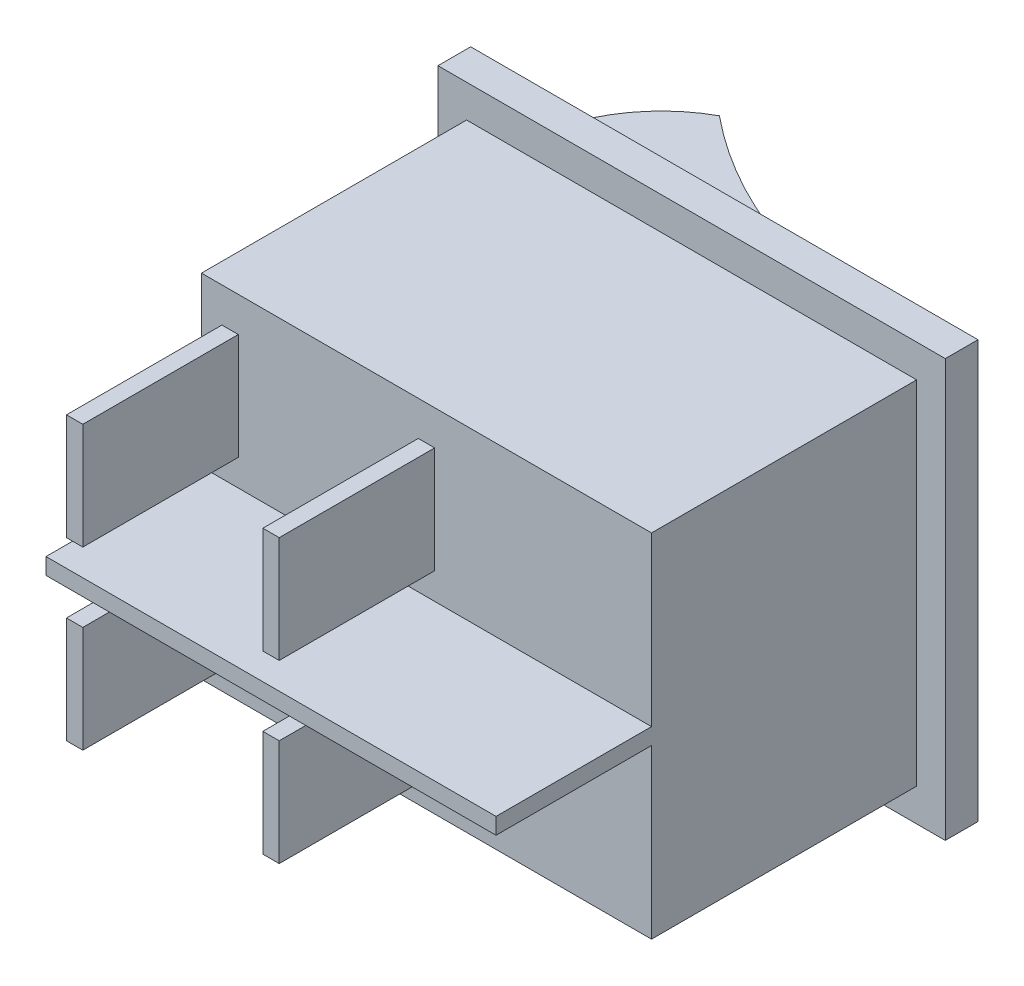
ISO-10303-21;
HEADER;
FILE_DESCRIPTION(('STEP AP214'),'2;1');
FILE_NAME('part.step','',(''),(''),'','','');
FILE_SCHEMA(('AUTOMOTIVE_DESIGN { 1 0 10303 214 1 1 1 1 }'));
ENDSEC;
DATA;
#1=APPLICATION_CONTEXT('core data for automotive mechanical design processes');
#2=APPLICATION_PROTOCOL_DEFINITION('international standard','automotive_design',2000,#1);
#3=PRODUCT_CONTEXT('',#1,'mechanical');
#4=PRODUCT('Part','Part','',(#3));
#5=PRODUCT_RELATED_PRODUCT_CATEGORY('part','',(#4));
#6=PRODUCT_DEFINITION_FORMATION('','',#4);
#7=PRODUCT_DEFINITION_CONTEXT('part definition',#1,'design');
#8=PRODUCT_DEFINITION('design','',#6,#7);
#9=PRODUCT_DEFINITION_SHAPE('','',#8);
#10=(LENGTH_UNIT() NAMED_UNIT(*) SI_UNIT(.MILLI.,.METRE.));
#11=(NAMED_UNIT(*) PLANE_ANGLE_UNIT() SI_UNIT($,.RADIAN.));
#12=(NAMED_UNIT(*) SI_UNIT($,.STERADIAN.) SOLID_ANGLE_UNIT());
#13=UNCERTAINTY_MEASURE_WITH_UNIT(LENGTH_MEASURE(1.E-05),#10,'distance_accuracy_value','');
#14=(GEOMETRIC_REPRESENTATION_CONTEXT(3) GLOBAL_UNCERTAINTY_ASSIGNED_CONTEXT((#13)) GLOBAL_UNIT_ASSIGNED_CONTEXT((#10,
#11,#12)) REPRESENTATION_CONTEXT('',''));
#15=CARTESIAN_POINT('',(0.,0.,0.));
#16=DIRECTION('',(0.,0.,1.));
#17=DIRECTION('',(1.,0.,0.));
#18=AXIS2_PLACEMENT_3D('',#15,#16,#17);
#19=CARTESIAN_POINT('',(0.,0.,0.));
#20=DIRECTION('',(0.,0.,1.));
#21=DIRECTION('',(1.,0.,0.));
#22=AXIS2_PLACEMENT_3D('',#19,#20,#21);
#23=PLANE('',#22);
#24=DIRECTION('',(0.,-1.,0.));
#25=VECTOR('',#24,1.);
#26=CARTESIAN_POINT('',(-15.5,-12.75,0.));
#27=LINE('',#26,#25);
#28=CARTESIAN_POINT('',(-15.5,12.75,0.));
#29=VERTEX_POINT('',#28);
#30=CARTESIAN_POINT('',(-15.5,-12.75,0.));
#31=VERTEX_POINT('',#30);
#32=EDGE_CURVE('E489',#29,#31,#27,.T.);
#33=ORIENTED_EDGE('',*,*,#32,.F.);
#34=DIRECTION('',(-1.,0.,0.));
#35=VECTOR('',#34,1.);
#36=CARTESIAN_POINT('',(15.5,12.75,0.));
#37=LINE('',#36,#35);
#38=CARTESIAN_POINT('',(15.5,12.75,0.));
#39=VERTEX_POINT('',#38);
#40=EDGE_CURVE('E494',#39,#29,#37,.T.);
#41=ORIENTED_EDGE('',*,*,#40,.F.);
#42=DIRECTION('',(0.,1.,0.));
#43=VECTOR('',#42,1.);
#44=CARTESIAN_POINT('',(15.5,-12.75,0.));
#45=LINE('',#44,#43);
#46=CARTESIAN_POINT('',(15.5,-12.75,0.));
#47=VERTEX_POINT('',#46);
#48=EDGE_CURVE('E505',#47,#39,#45,.T.);
#49=ORIENTED_EDGE('',*,*,#48,.F.);
#50=DIRECTION('',(1.,0.,0.));
#51=VECTOR('',#50,1.);
#52=CARTESIAN_POINT('',(15.5,-12.75,0.));
#53=LINE('',#52,#51);
#54=EDGE_CURVE('E503',#31,#47,#53,.T.);
#55=ORIENTED_EDGE('',*,*,#54,.F.);
#56=EDGE_LOOP('',(#33,#41,#49,#55));
#57=FACE_BOUND('',#56,.T.);
#58=DIRECTION('',(0.,-1.,0.));
#59=VECTOR('',#58,1.);
#60=CARTESIAN_POINT('',(12.,-9.5,0.));
#61=LINE('',#60,#59);
#62=CARTESIAN_POINT('',(12.,9.5,0.));
#63=VERTEX_POINT('',#62);
#64=CARTESIAN_POINT('',(12.,-9.5,0.));
#65=VERTEX_POINT('',#64);
#66=EDGE_CURVE('E58',#63,#65,#61,.T.);
#67=ORIENTED_EDGE('',*,*,#66,.F.);
#68=DIRECTION('',(1.,0.,0.));
#69=VECTOR('',#68,1.);
#70=CARTESIAN_POINT('',(-12.,9.50000000000001,0.));
#71=LINE('',#70,#69);
#72=CARTESIAN_POINT('',(-12.,9.50000000000001,0.));
#73=VERTEX_POINT('',#72);
#74=EDGE_CURVE('E289',#73,#63,#71,.T.);
#75=ORIENTED_EDGE('',*,*,#74,.F.);
#76=DIRECTION('',(0.,1.,0.));
#77=VECTOR('',#76,1.);
#78=CARTESIAN_POINT('',(-12.,-9.49999999999999,0.));
#79=LINE('',#78,#77);
#80=CARTESIAN_POINT('',(-12.,-9.49999999999999,0.));
#81=VERTEX_POINT('',#80);
#82=EDGE_CURVE('E298',#81,#73,#79,.T.);
#83=ORIENTED_EDGE('',*,*,#82,.F.);
#84=DIRECTION('',(-1.,0.,0.));
#85=VECTOR('',#84,1.);
#86=CARTESIAN_POINT('',(-12.,-9.49999999999999,0.));
#87=LINE('',#86,#85);
#88=EDGE_CURVE('E295',#65,#81,#87,.T.);
#89=ORIENTED_EDGE('',*,*,#88,.F.);
#90=EDGE_LOOP('',(#67,#75,#83,#89));
#91=FACE_BOUND('',#90,.T.);
#92=ADVANCED_FACE('F35',(#57,#91),#23,.F.);
#93=CARTESIAN_POINT('',(0.,0.,18.2));
#94=DIRECTION('',(0.,0.,1.));
#95=DIRECTION('',(1.,0.,0.));
#96=AXIS2_PLACEMENT_3D('',#93,#94,#95);
#97=PLANE('',#96);
#98=DIRECTION('',(-1.,0.,0.));
#99=VECTOR('',#98,1.);
#100=CARTESIAN_POINT('',(0.5,-2.125,18.2));
#101=LINE('',#100,#99);
#102=CARTESIAN_POINT('',(0.5,-2.125,18.2));
#103=VERTEX_POINT('',#102);
#104=CARTESIAN_POINT('',(-0.500000000000001,-2.125,18.2));
#105=VERTEX_POINT('',#104);
#106=EDGE_CURVE('E382',#103,#105,#101,.T.);
#107=ORIENTED_EDGE('',*,*,#106,.F.);
#108=DIRECTION('',(0.,1.,0.));
#109=VECTOR('',#108,1.);
#110=CARTESIAN_POINT('',(0.5,-2.125,18.2));
#111=LINE('',#110,#109);
#112=CARTESIAN_POINT('',(0.5,-8.625,18.2));
#113=VERTEX_POINT('',#112);
#114=EDGE_CURVE('E368',#113,#103,#111,.T.);
#115=ORIENTED_EDGE('',*,*,#114,.F.);
#116=DIRECTION('',(1.,0.,0.));
#117=VECTOR('',#116,1.);
#118=CARTESIAN_POINT('',(0.5,-8.625,18.2));
#119=LINE('',#118,#117);
#120=CARTESIAN_POINT('',(-0.500000000000001,-8.625,18.2));
#121=VERTEX_POINT('',#120);
#122=EDGE_CURVE('E373',#121,#113,#119,.T.);
#123=ORIENTED_EDGE('',*,*,#122,.F.);
#124=DIRECTION('',(0.,-1.,0.));
#125=VECTOR('',#124,1.);
#126=CARTESIAN_POINT('',(-0.500000000000001,-2.125,18.2));
#127=LINE('',#126,#125);
#128=EDGE_CURVE('E384',#105,#121,#127,.T.);
#129=ORIENTED_EDGE('',*,*,#128,.F.);
#130=EDGE_LOOP('',(#107,#115,#123,#129));
#131=FACE_BOUND('',#130,.T.);
#132=DIRECTION('',(-1.,0.,0.));
#133=VECTOR('',#132,1.);
#134=CARTESIAN_POINT('',(-11.5,-2.125,18.2));
#135=LINE('',#134,#133);
#136=CARTESIAN_POINT('',(-11.5,-2.125,18.2));
#137=VERTEX_POINT('',#136);
#138=CARTESIAN_POINT('',(-12.5,-2.125,18.2));
#139=VERTEX_POINT('',#138);
#140=EDGE_CURVE('E353',#137,#139,#135,.T.);
#141=ORIENTED_EDGE('',*,*,#140,.F.);
#142=DIRECTION('',(0.,1.,0.));
#143=VECTOR('',#142,1.);
#144=CARTESIAN_POINT('',(-11.5,-2.125,18.2));
#145=LINE('',#144,#143);
#146=CARTESIAN_POINT('',(-11.5,-8.625,18.2));
#147=VERTEX_POINT('',#146);
#148=EDGE_CURVE('E339',#147,#137,#145,.T.);
#149=ORIENTED_EDGE('',*,*,#148,.F.);
#150=DIRECTION('',(1.,0.,0.));
#151=VECTOR('',#150,1.);
#152=CARTESIAN_POINT('',(-11.5,-8.625,18.2));
#153=LINE('',#152,#151);
#154=CARTESIAN_POINT('',(-12.5,-8.625,18.2));
#155=VERTEX_POINT('',#154);
#156=EDGE_CURVE('E344',#155,#147,#153,.T.);
#157=ORIENTED_EDGE('',*,*,#156,.F.);
#158=DIRECTION('',(0.,-1.,0.));
#159=VECTOR('',#158,1.);
#160=CARTESIAN_POINT('',(-12.5,-2.125,18.2));
#161=LINE('',#160,#159);
#162=EDGE_CURVE('E355',#139,#155,#161,.T.);
#163=ORIENTED_EDGE('',*,*,#162,.F.);
#164=EDGE_LOOP('',(#141,#149,#157,#163));
#165=FACE_BOUND('',#164,.T.);
#166=DIRECTION('',(0.,1.,0.));
#167=VECTOR('',#166,1.);
#168=CARTESIAN_POINT('',(13.75,-10.75,18.2));
#169=LINE('',#168,#167);
#170=CARTESIAN_POINT('',(13.75,-10.75,18.2));
#171=VERTEX_POINT('',#170);
#172=CARTESIAN_POINT('',(13.75,-0.5,18.2));
#173=VERTEX_POINT('',#172);
#174=EDGE_CURVE('E462',#171,#173,#169,.T.);
#175=ORIENTED_EDGE('',*,*,#174,.T.);
#176=DIRECTION('',(1.,0.,0.));
#177=VECTOR('',#176,1.);
#178=CARTESIAN_POINT('',(13.75,-0.5,18.2));
#179=LINE('',#178,#177);
#180=CARTESIAN_POINT('',(-13.75,-0.5,18.2));
#181=VERTEX_POINT('',#180);
#182=EDGE_CURVE('E312',#181,#173,#179,.T.);
#183=ORIENTED_EDGE('',*,*,#182,.F.);
#184=DIRECTION('',(0.,-1.,0.));
#185=VECTOR('',#184,1.);
#186=CARTESIAN_POINT('',(-13.75,-10.75,18.2));
#187=LINE('',#186,#185);
#188=CARTESIAN_POINT('',(-13.75,-10.75,18.2));
#189=VERTEX_POINT('',#188);
#190=EDGE_CURVE('E459',#181,#189,#187,.T.);
#191=ORIENTED_EDGE('',*,*,#190,.T.);
#192=DIRECTION('',(1.,0.,0.));
#193=VECTOR('',#192,1.);
#194=CARTESIAN_POINT('',(13.75,-10.75,18.2));
#195=LINE('',#194,#193);
#196=EDGE_CURVE('E458',#189,#171,#195,.T.);
#197=ORIENTED_EDGE('',*,*,#196,.T.);
#198=EDGE_LOOP('',(#175,#183,#191,#197));
#199=FACE_BOUND('',#198,.T.);
#200=ADVANCED_FACE('F541',(#131,#165,#199),#97,.T.);
#201=DIRECTION('',(1.,0.,0.));
#202=VECTOR('',#201,1.);
#203=CARTESIAN_POINT('',(0.5,2.125,18.2));
#204=LINE('',#203,#202);
#205=CARTESIAN_POINT('',(-0.500000000000001,2.125,18.2));
#206=VERTEX_POINT('',#205);
#207=CARTESIAN_POINT('',(0.5,2.125,18.2));
#208=VERTEX_POINT('',#207);
#209=EDGE_CURVE('E411',#206,#208,#204,.T.);
#210=ORIENTED_EDGE('',*,*,#209,.F.);
#211=DIRECTION('',(0.,-1.,0.));
#212=VECTOR('',#211,1.);
#213=CARTESIAN_POINT('',(-0.500000000000001,2.125,18.2));
#214=LINE('',#213,#212);
#215=CARTESIAN_POINT('',(-0.500000000000001,8.625,18.2));
#216=VERTEX_POINT('',#215);
#217=EDGE_CURVE('E397',#216,#206,#214,.T.);
#218=ORIENTED_EDGE('',*,*,#217,.F.);
#219=DIRECTION('',(-1.,0.,0.));
#220=VECTOR('',#219,1.);
#221=CARTESIAN_POINT('',(0.5,8.625,18.2));
#222=LINE('',#221,#220);
#223=CARTESIAN_POINT('',(0.5,8.625,18.2));
#224=VERTEX_POINT('',#223);
#225=EDGE_CURVE('E402',#224,#216,#222,.T.);
#226=ORIENTED_EDGE('',*,*,#225,.F.);
#227=DIRECTION('',(0.,1.,0.));
#228=VECTOR('',#227,1.);
#229=CARTESIAN_POINT('',(0.5,2.125,18.2));
#230=LINE('',#229,#228);
#231=EDGE_CURVE('E413',#208,#224,#230,.T.);
#232=ORIENTED_EDGE('',*,*,#231,.F.);
#233=EDGE_LOOP('',(#210,#218,#226,#232));
#234=FACE_BOUND('',#233,.T.);
#235=DIRECTION('',(1.,0.,0.));
#236=VECTOR('',#235,1.);
#237=CARTESIAN_POINT('',(-11.5,2.125,18.2));
#238=LINE('',#237,#236);
#239=CARTESIAN_POINT('',(-12.5,2.125,18.2));
#240=VERTEX_POINT('',#239);
#241=CARTESIAN_POINT('',(-11.5,2.125,18.2));
#242=VERTEX_POINT('',#241);
#243=EDGE_CURVE('E440',#240,#242,#238,.T.);
#244=ORIENTED_EDGE('',*,*,#243,.F.);
#245=DIRECTION('',(0.,-1.,0.));
#246=VECTOR('',#245,1.);
#247=CARTESIAN_POINT('',(-12.5,2.125,18.2));
#248=LINE('',#247,#246);
#249=CARTESIAN_POINT('',(-12.5,8.625,18.2));
#250=VERTEX_POINT('',#249);
#251=EDGE_CURVE('E426',#250,#240,#248,.T.);
#252=ORIENTED_EDGE('',*,*,#251,.F.);
#253=DIRECTION('',(-1.,0.,0.));
#254=VECTOR('',#253,1.);
#255=CARTESIAN_POINT('',(-11.5,8.625,18.2));
#256=LINE('',#255,#254);
#257=CARTESIAN_POINT('',(-11.5,8.625,18.2));
#258=VERTEX_POINT('',#257);
#259=EDGE_CURVE('E431',#258,#250,#256,.T.);
#260=ORIENTED_EDGE('',*,*,#259,.F.);
#261=DIRECTION('',(0.,1.,0.));
#262=VECTOR('',#261,1.);
#263=CARTESIAN_POINT('',(-11.5,2.125,18.2));
#264=LINE('',#263,#262);
#265=EDGE_CURVE('E442',#242,#258,#264,.T.);
#266=ORIENTED_EDGE('',*,*,#265,.F.);
#267=EDGE_LOOP('',(#244,#252,#260,#266));
#268=FACE_BOUND('',#267,.T.);
#269=CARTESIAN_POINT('',(-13.75,10.75,18.2));
#270=VERTEX_POINT('',#269);
#271=CARTESIAN_POINT('',(-13.75,0.5,18.2));
#272=VERTEX_POINT('',#271);
#273=EDGE_CURVE('E456',#270,#272,#187,.T.);
#274=ORIENTED_EDGE('',*,*,#273,.T.);
#275=DIRECTION('',(-1.,0.,0.));
#276=VECTOR('',#275,1.);
#277=CARTESIAN_POINT('',(13.75,0.5,18.2));
#278=LINE('',#277,#276);
#279=CARTESIAN_POINT('',(13.75,0.5,18.2));
#280=VERTEX_POINT('',#279);
#281=EDGE_CURVE('E317',#280,#272,#278,.T.);
#282=ORIENTED_EDGE('',*,*,#281,.F.);
#283=CARTESIAN_POINT('',(13.75,10.75,18.2));
#284=VERTEX_POINT('',#283);
#285=EDGE_CURVE('E461',#280,#284,#169,.T.);
#286=ORIENTED_EDGE('',*,*,#285,.T.);
#287=DIRECTION('',(-1.,0.,0.));
#288=VECTOR('',#287,1.);
#289=CARTESIAN_POINT('',(13.75,10.75,18.2));
#290=LINE('',#289,#288);
#291=EDGE_CURVE('E464',#284,#270,#290,.T.);
#292=ORIENTED_EDGE('',*,*,#291,.T.);
#293=EDGE_LOOP('',(#274,#282,#286,#292));
#294=FACE_BOUND('',#293,.T.);
#295=ADVANCED_FACE('F539',(#234,#268,#294),#97,.T.);
#296=CARTESIAN_POINT('',(-15.5,-12.75,2.));
#297=DIRECTION('',(1.,0.,0.));
#298=DIRECTION('',(0.,0.,-1.));
#299=AXIS2_PLACEMENT_3D('',#296,#297,#298);
#300=PLANE('',#299);
#301=ORIENTED_EDGE('',*,*,#32,.T.);
#302=DIRECTION('',(0.,0.,-1.));
#303=VECTOR('',#302,1.);
#304=CARTESIAN_POINT('',(-15.5,-12.75,2.));
#305=LINE('',#304,#303);
#306=CARTESIAN_POINT('',(-15.5,-12.75,2.));
#307=VERTEX_POINT('',#306);
#308=EDGE_CURVE('E11',#307,#31,#305,.T.);
#309=ORIENTED_EDGE('',*,*,#308,.F.);
#310=DIRECTION('',(0.,-1.,0.));
#311=VECTOR('',#310,1.);
#312=CARTESIAN_POINT('',(-15.5,-12.75,2.));
#313=LINE('',#312,#311);
#314=CARTESIAN_POINT('',(-15.5,12.75,2.));
#315=VERTEX_POINT('',#314);
#316=EDGE_CURVE('E490',#315,#307,#313,.T.);
#317=ORIENTED_EDGE('',*,*,#316,.F.);
#318=DIRECTION('',(0.,0.,-1.));
#319=VECTOR('',#318,1.);
#320=CARTESIAN_POINT('',(-15.5,12.75,2.));
#321=LINE('',#320,#319);
#322=EDGE_CURVE('E500',#315,#29,#321,.T.);
#323=ORIENTED_EDGE('',*,*,#322,.T.);
#324=EDGE_LOOP('',(#301,#309,#317,#323));
#325=FACE_BOUND('',#324,.T.);
#326=ADVANCED_FACE('F37',(#325),#300,.F.);
#327=CARTESIAN_POINT('',(15.5,-12.75,2.));
#328=DIRECTION('',(0.,1.,0.));
#329=DIRECTION('',(-1.,0.,0.));
#330=AXIS2_PLACEMENT_3D('',#327,#328,#329);
#331=PLANE('',#330);
#332=ORIENTED_EDGE('',*,*,#54,.T.);
#333=DIRECTION('',(0.,0.,-1.));
#334=VECTOR('',#333,1.);
#335=CARTESIAN_POINT('',(15.5,-12.75,2.));
#336=LINE('',#335,#334);
#337=CARTESIAN_POINT('',(15.5,-12.75,2.));
#338=VERTEX_POINT('',#337);
#339=EDGE_CURVE('E43',#338,#47,#336,.T.);
#340=ORIENTED_EDGE('',*,*,#339,.F.);
#341=DIRECTION('',(1.,0.,0.));
#342=VECTOR('',#341,1.);
#343=CARTESIAN_POINT('',(15.5,-12.75,2.));
#344=LINE('',#343,#342);
#345=EDGE_CURVE('E493',#307,#338,#344,.T.);
#346=ORIENTED_EDGE('',*,*,#345,.F.);
#347=ORIENTED_EDGE('',*,*,#308,.T.);
#348=EDGE_LOOP('',(#332,#340,#346,#347));
#349=FACE_BOUND('',#348,.T.);
#350=ADVANCED_FACE('F532',(#349),#331,.F.);
#351=CARTESIAN_POINT('',(15.5,-12.75,2.));
#352=DIRECTION('',(-1.,0.,0.));
#353=DIRECTION('',(0.,0.,1.));
#354=AXIS2_PLACEMENT_3D('',#351,#352,#353);
#355=PLANE('',#354);
#356=ORIENTED_EDGE('',*,*,#48,.T.);
#357=DIRECTION('',(0.,0.,-1.));
#358=VECTOR('',#357,1.);
#359=CARTESIAN_POINT('',(15.5,12.75,2.));
#360=LINE('',#359,#358);
#361=CARTESIAN_POINT('',(15.5,12.75,2.));
#362=VERTEX_POINT('',#361);
#363=EDGE_CURVE('E510',#362,#39,#360,.T.);
#364=ORIENTED_EDGE('',*,*,#363,.F.);
#365=DIRECTION('',(0.,1.,0.));
#366=VECTOR('',#365,1.);
#367=CARTESIAN_POINT('',(15.5,-12.75,2.));
#368=LINE('',#367,#366);
#369=EDGE_CURVE('E496',#338,#362,#368,.T.);
#370=ORIENTED_EDGE('',*,*,#369,.F.);
#371=ORIENTED_EDGE('',*,*,#339,.T.);
#372=EDGE_LOOP('',(#356,#364,#370,#371));
#373=FACE_BOUND('',#372,.T.);
#374=ADVANCED_FACE('F517',(#373),#355,.F.);
#375=CARTESIAN_POINT('',(15.5,12.75,2.));
#376=DIRECTION('',(0.,-1.,0.));
#377=DIRECTION('',(1.,0.,0.));
#378=AXIS2_PLACEMENT_3D('',#375,#376,#377);
#379=PLANE('',#378);
#380=ORIENTED_EDGE('',*,*,#40,.T.);
#381=ORIENTED_EDGE('',*,*,#322,.F.);
#382=DIRECTION('',(-1.,0.,0.));
#383=VECTOR('',#382,1.);
#384=CARTESIAN_POINT('',(15.5,12.75,2.));
#385=LINE('',#384,#383);
#386=EDGE_CURVE('E498',#362,#315,#385,.T.);
#387=ORIENTED_EDGE('',*,*,#386,.F.);
#388=ORIENTED_EDGE('',*,*,#363,.T.);
#389=EDGE_LOOP('',(#380,#381,#387,#388));
#390=FACE_BOUND('',#389,.T.);
#391=ADVANCED_FACE('F525',(#390),#379,.F.);
#392=CARTESIAN_POINT('',(0.,0.,2.));
#393=DIRECTION('',(0.,0.,1.));
#394=DIRECTION('',(1.,0.,0.));
#395=AXIS2_PLACEMENT_3D('',#392,#393,#394);
#396=PLANE('',#395);
#397=DIRECTION('',(0.,-1.,0.));
#398=VECTOR('',#397,1.);
#399=CARTESIAN_POINT('',(-13.75,-10.75,2.));
#400=LINE('',#399,#398);
#401=CARTESIAN_POINT('',(-13.75,10.75,2.));
#402=VERTEX_POINT('',#401);
#403=CARTESIAN_POINT('',(-13.75,-10.75,2.));
#404=VERTEX_POINT('',#403);
#405=EDGE_CURVE('E455',#402,#404,#400,.T.);
#406=ORIENTED_EDGE('',*,*,#405,.F.);
#407=DIRECTION('',(-1.,0.,0.));
#408=VECTOR('',#407,1.);
#409=CARTESIAN_POINT('',(13.75,10.75,2.));
#410=LINE('',#409,#408);
#411=CARTESIAN_POINT('',(13.75,10.75,2.));
#412=VERTEX_POINT('',#411);
#413=EDGE_CURVE('E475',#412,#402,#410,.T.);
#414=ORIENTED_EDGE('',*,*,#413,.F.);
#415=DIRECTION('',(0.,1.,0.));
#416=VECTOR('',#415,1.);
#417=CARTESIAN_POINT('',(13.75,-10.75,2.));
#418=LINE('',#417,#416);
#419=CARTESIAN_POINT('',(13.75,-10.75,2.));
#420=VERTEX_POINT('',#419);
#421=EDGE_CURVE('E472',#420,#412,#418,.T.);
#422=ORIENTED_EDGE('',*,*,#421,.F.);
#423=DIRECTION('',(1.,0.,0.));
#424=VECTOR('',#423,1.);
#425=CARTESIAN_POINT('',(13.75,-10.75,2.));
#426=LINE('',#425,#424);
#427=EDGE_CURVE('E469',#404,#420,#426,.T.);
#428=ORIENTED_EDGE('',*,*,#427,.F.);
#429=EDGE_LOOP('',(#406,#414,#422,#428));
#430=FACE_BOUND('',#429,.T.);
#431=ORIENTED_EDGE('',*,*,#316,.T.);
#432=ORIENTED_EDGE('',*,*,#345,.T.);
#433=ORIENTED_EDGE('',*,*,#369,.T.);
#434=ORIENTED_EDGE('',*,*,#386,.T.);
#435=EDGE_LOOP('',(#431,#432,#433,#434));
#436=FACE_BOUND('',#435,.T.);
#437=ADVANCED_FACE('F531',(#430,#436),#396,.T.);
#438=CARTESIAN_POINT('',(-13.75,-10.75,18.2));
#439=DIRECTION('',(1.,0.,0.));
#440=DIRECTION('',(0.,0.,-1.));
#441=AXIS2_PLACEMENT_3D('',#438,#439,#440);
#442=PLANE('',#441);
#443=ORIENTED_EDGE('',*,*,#405,.T.);
#444=DIRECTION('',(0.,0.,-1.));
#445=VECTOR('',#444,1.);
#446=CARTESIAN_POINT('',(-13.75,-10.75,18.2));
#447=LINE('',#446,#445);
#448=EDGE_CURVE('E486',#189,#404,#447,.T.);
#449=ORIENTED_EDGE('',*,*,#448,.F.);
#450=ORIENTED_EDGE('',*,*,#190,.F.);
#451=DIRECTION('',(0.,0.,-1.));
#452=VECTOR('',#451,1.);
#453=CARTESIAN_POINT('',(-13.75,-0.5,27.7));
#454=LINE('',#453,#452);
#455=CARTESIAN_POINT('',(-13.75,-0.5,27.7));
#456=VERTEX_POINT('',#455);
#457=EDGE_CURVE('E336',#456,#181,#454,.T.);
#458=ORIENTED_EDGE('',*,*,#457,.F.);
#459=DIRECTION('',(0.,-1.,0.));
#460=VECTOR('',#459,1.);
#461=CARTESIAN_POINT('',(-13.75,-0.5,27.7));
#462=LINE('',#461,#460);
#463=CARTESIAN_POINT('',(-13.75,0.5,27.7));
#464=VERTEX_POINT('',#463);
#465=EDGE_CURVE('E313',#464,#456,#462,.T.);
#466=ORIENTED_EDGE('',*,*,#465,.F.);
#467=DIRECTION('',(0.,0.,-1.));
#468=VECTOR('',#467,1.);
#469=CARTESIAN_POINT('',(-13.75,0.5,27.7));
#470=LINE('',#469,#468);
#471=EDGE_CURVE('E323',#464,#272,#470,.T.);
#472=ORIENTED_EDGE('',*,*,#471,.T.);
#473=ORIENTED_EDGE('',*,*,#273,.F.);
#474=DIRECTION('',(0.,0.,-1.));
#475=VECTOR('',#474,1.);
#476=CARTESIAN_POINT('',(-13.75,10.75,18.2));
#477=LINE('',#476,#475);
#478=EDGE_CURVE('E466',#270,#402,#477,.T.);
#479=ORIENTED_EDGE('',*,*,#478,.T.);
#480=EDGE_LOOP('',(#443,#449,#450,#458,#466,#472,#473,#479));
#481=FACE_BOUND('',#480,.T.);
#482=ADVANCED_FACE('F555',(#481),#442,.F.);
#483=CARTESIAN_POINT('',(13.75,-10.75,18.2));
#484=DIRECTION('',(0.,1.,0.));
#485=DIRECTION('',(-1.,0.,0.));
#486=AXIS2_PLACEMENT_3D('',#483,#484,#485);
#487=PLANE('',#486);
#488=ORIENTED_EDGE('',*,*,#427,.T.);
#489=DIRECTION('',(0.,0.,-1.));
#490=VECTOR('',#489,1.);
#491=CARTESIAN_POINT('',(13.75,-10.75,18.2));
#492=LINE('',#491,#490);
#493=EDGE_CURVE('E483',#171,#420,#492,.T.);
#494=ORIENTED_EDGE('',*,*,#493,.F.);
#495=ORIENTED_EDGE('',*,*,#196,.F.);
#496=ORIENTED_EDGE('',*,*,#448,.T.);
#497=EDGE_LOOP('',(#488,#494,#495,#496));
#498=FACE_BOUND('',#497,.T.);
#499=ADVANCED_FACE('F560',(#498),#487,.F.);
#500=CARTESIAN_POINT('',(13.75,-10.75,18.2));
#501=DIRECTION('',(-1.,0.,0.));
#502=DIRECTION('',(0.,-1.,0.));
#503=AXIS2_PLACEMENT_3D('',#500,#501,#502);
#504=PLANE('',#503);
#505=ORIENTED_EDGE('',*,*,#421,.T.);
#506=DIRECTION('',(0.,0.,-1.));
#507=VECTOR('',#506,1.);
#508=CARTESIAN_POINT('',(13.75,10.75,18.2));
#509=LINE('',#508,#507);
#510=EDGE_CURVE('E480',#284,#412,#509,.T.);
#511=ORIENTED_EDGE('',*,*,#510,.F.);
#512=ORIENTED_EDGE('',*,*,#285,.F.);
#513=DIRECTION('',(0.,0.,-1.));
#514=VECTOR('',#513,1.);
#515=CARTESIAN_POINT('',(13.75,0.5,27.7));
#516=LINE('',#515,#514);
#517=CARTESIAN_POINT('',(13.75,0.5,27.7));
#518=VERTEX_POINT('',#517);
#519=EDGE_CURVE('E330',#518,#280,#516,.T.);
#520=ORIENTED_EDGE('',*,*,#519,.F.);
#521=DIRECTION('',(0.,1.,0.));
#522=VECTOR('',#521,1.);
#523=CARTESIAN_POINT('',(13.75,-0.5,27.7));
#524=LINE('',#523,#522);
#525=CARTESIAN_POINT('',(13.75,-0.5,27.7));
#526=VERTEX_POINT('',#525);
#527=EDGE_CURVE('E319',#526,#518,#524,.T.);
#528=ORIENTED_EDGE('',*,*,#527,.F.);
#529=DIRECTION('',(0.,0.,-1.));
#530=VECTOR('',#529,1.);
#531=CARTESIAN_POINT('',(13.75,-0.5,27.7));
#532=LINE('',#531,#530);
#533=EDGE_CURVE('E333',#526,#173,#532,.T.);
#534=ORIENTED_EDGE('',*,*,#533,.T.);
#535=ORIENTED_EDGE('',*,*,#174,.F.);
#536=ORIENTED_EDGE('',*,*,#493,.T.);
#537=EDGE_LOOP('',(#505,#511,#512,#520,#528,#534,#535,#536));
#538=FACE_BOUND('',#537,.T.);
#539=ADVANCED_FACE('F579',(#538),#504,.F.);
#540=CARTESIAN_POINT('',(13.75,10.75,18.2));
#541=DIRECTION('',(0.,-1.,0.));
#542=DIRECTION('',(1.,0.,0.));
#543=AXIS2_PLACEMENT_3D('',#540,#541,#542);
#544=PLANE('',#543);
#545=ORIENTED_EDGE('',*,*,#413,.T.);
#546=ORIENTED_EDGE('',*,*,#478,.F.);
#547=ORIENTED_EDGE('',*,*,#291,.F.);
#548=ORIENTED_EDGE('',*,*,#510,.T.);
#549=EDGE_LOOP('',(#545,#546,#547,#548));
#550=FACE_BOUND('',#549,.T.);
#551=ADVANCED_FACE('F565',(#550),#544,.F.);
#552=CARTESIAN_POINT('',(-12.5,2.125,27.7));
#553=DIRECTION('',(1.,0.,0.));
#554=DIRECTION('',(0.,0.,-1.));
#555=AXIS2_PLACEMENT_3D('',#552,#553,#554);
#556=PLANE('',#555);
#557=ORIENTED_EDGE('',*,*,#251,.T.);
#558=DIRECTION('',(0.,0.,-1.));
#559=VECTOR('',#558,1.);
#560=CARTESIAN_POINT('',(-12.5,2.125,27.7));
#561=LINE('',#560,#559);
#562=CARTESIAN_POINT('',(-12.5,2.125,27.7));
#563=VERTEX_POINT('',#562);
#564=EDGE_CURVE('E453',#563,#240,#561,.T.);
#565=ORIENTED_EDGE('',*,*,#564,.F.);
#566=DIRECTION('',(0.,-1.,0.));
#567=VECTOR('',#566,1.);
#568=CARTESIAN_POINT('',(-12.5,2.125,27.7));
#569=LINE('',#568,#567);
#570=CARTESIAN_POINT('',(-12.5,8.625,27.7));
#571=VERTEX_POINT('',#570);
#572=EDGE_CURVE('E427',#571,#563,#569,.T.);
#573=ORIENTED_EDGE('',*,*,#572,.F.);
#574=DIRECTION('',(0.,0.,-1.));
#575=VECTOR('',#574,1.);
#576=CARTESIAN_POINT('',(-12.5,8.625,27.7));
#577=LINE('',#576,#575);
#578=EDGE_CURVE('E437',#571,#250,#577,.T.);
#579=ORIENTED_EDGE('',*,*,#578,.T.);
#580=EDGE_LOOP('',(#557,#565,#573,#579));
#581=FACE_BOUND('',#580,.T.);
#582=ADVANCED_FACE('F682',(#581),#556,.F.);
#583=CARTESIAN_POINT('',(-11.5,2.125,27.7));
#584=DIRECTION('',(0.,1.,0.));
#585=DIRECTION('',(0.,0.,1.));
#586=AXIS2_PLACEMENT_3D('',#583,#584,#585);
#587=PLANE('',#586);
#588=ORIENTED_EDGE('',*,*,#243,.T.);
#589=DIRECTION('',(0.,0.,-1.));
#590=VECTOR('',#589,1.);
#591=CARTESIAN_POINT('',(-11.5,2.125,27.7));
#592=LINE('',#591,#590);
#593=CARTESIAN_POINT('',(-11.5,2.125,27.7));
#594=VERTEX_POINT('',#593);
#595=EDGE_CURVE('E450',#594,#242,#592,.T.);
#596=ORIENTED_EDGE('',*,*,#595,.F.);
#597=DIRECTION('',(1.,0.,0.));
#598=VECTOR('',#597,1.);
#599=CARTESIAN_POINT('',(-11.5,2.125,27.7));
#600=LINE('',#599,#598);
#601=EDGE_CURVE('E430',#563,#594,#600,.T.);
#602=ORIENTED_EDGE('',*,*,#601,.F.);
#603=ORIENTED_EDGE('',*,*,#564,.T.);
#604=EDGE_LOOP('',(#588,#596,#602,#603));
#605=FACE_BOUND('',#604,.T.);
#606=ADVANCED_FACE('F678',(#605),#587,.F.);
#607=CARTESIAN_POINT('',(-11.5,2.125,27.7));
#608=DIRECTION('',(-1.,0.,0.));
#609=DIRECTION('',(0.,0.,1.));
#610=AXIS2_PLACEMENT_3D('',#607,#608,#609);
#611=PLANE('',#610);
#612=ORIENTED_EDGE('',*,*,#265,.T.);
#613=DIRECTION('',(0.,0.,-1.));
#614=VECTOR('',#613,1.);
#615=CARTESIAN_POINT('',(-11.5,8.625,27.7));
#616=LINE('',#615,#614);
#617=CARTESIAN_POINT('',(-11.5,8.625,27.7));
#618=VERTEX_POINT('',#617);
#619=EDGE_CURVE('E448',#618,#258,#616,.T.);
#620=ORIENTED_EDGE('',*,*,#619,.F.);
#621=DIRECTION('',(0.,1.,0.));
#622=VECTOR('',#621,1.);
#623=CARTESIAN_POINT('',(-11.5,2.125,27.7));
#624=LINE('',#623,#622);
#625=EDGE_CURVE('E433',#594,#618,#624,.T.);
#626=ORIENTED_EDGE('',*,*,#625,.F.);
#627=ORIENTED_EDGE('',*,*,#595,.T.);
#628=EDGE_LOOP('',(#612,#620,#626,#627));
#629=FACE_BOUND('',#628,.T.);
#630=ADVANCED_FACE('F674',(#629),#611,.F.);
#631=CARTESIAN_POINT('',(-11.5,8.625,27.7));
#632=DIRECTION('',(0.,-1.,0.));
#633=DIRECTION('',(0.,0.,-1.));
#634=AXIS2_PLACEMENT_3D('',#631,#632,#633);
#635=PLANE('',#634);
#636=ORIENTED_EDGE('',*,*,#259,.T.);
#637=ORIENTED_EDGE('',*,*,#578,.F.);
#638=DIRECTION('',(-1.,0.,0.));
#639=VECTOR('',#638,1.);
#640=CARTESIAN_POINT('',(-11.5,8.625,27.7));
#641=LINE('',#640,#639);
#642=EDGE_CURVE('E435',#618,#571,#641,.T.);
#643=ORIENTED_EDGE('',*,*,#642,.F.);
#644=ORIENTED_EDGE('',*,*,#619,.T.);
#645=EDGE_LOOP('',(#636,#637,#643,#644));
#646=FACE_BOUND('',#645,.T.);
#647=ADVANCED_FACE('F670',(#646),#635,.F.);
#648=CARTESIAN_POINT('',(0.,0.,27.7));
#649=DIRECTION('',(0.,0.,1.));
#650=DIRECTION('',(1.,0.,0.));
#651=AXIS2_PLACEMENT_3D('',#648,#649,#650);
#652=PLANE('',#651);
#653=ORIENTED_EDGE('',*,*,#572,.T.);
#654=ORIENTED_EDGE('',*,*,#601,.T.);
#655=ORIENTED_EDGE('',*,*,#625,.T.);
#656=ORIENTED_EDGE('',*,*,#642,.T.);
#657=EDGE_LOOP('',(#653,#654,#655,#656));
#658=FACE_BOUND('',#657,.T.);
#659=ADVANCED_FACE('F666',(#658),#652,.T.);
#660=CARTESIAN_POINT('',(-0.500000000000001,2.125,27.7));
#661=DIRECTION('',(1.,0.,0.));
#662=DIRECTION('',(0.,0.,-1.));
#663=AXIS2_PLACEMENT_3D('',#660,#661,#662);
#664=PLANE('',#663);
#665=ORIENTED_EDGE('',*,*,#217,.T.);
#666=DIRECTION('',(0.,0.,-1.));
#667=VECTOR('',#666,1.);
#668=CARTESIAN_POINT('',(-0.500000000000001,2.125,27.7));
#669=LINE('',#668,#667);
#670=CARTESIAN_POINT('',(-0.500000000000001,2.125,27.7));
#671=VERTEX_POINT('',#670);
#672=EDGE_CURVE('E424',#671,#206,#669,.T.);
#673=ORIENTED_EDGE('',*,*,#672,.F.);
#674=DIRECTION('',(0.,-1.,0.));
#675=VECTOR('',#674,1.);
#676=CARTESIAN_POINT('',(-0.500000000000001,2.125,27.7));
#677=LINE('',#676,#675);
#678=CARTESIAN_POINT('',(-0.500000000000001,8.625,27.7));
#679=VERTEX_POINT('',#678);
#680=EDGE_CURVE('E398',#679,#671,#677,.T.);
#681=ORIENTED_EDGE('',*,*,#680,.F.);
#682=DIRECTION('',(0.,0.,-1.));
#683=VECTOR('',#682,1.);
#684=CARTESIAN_POINT('',(-0.500000000000001,8.625,27.7));
#685=LINE('',#684,#683);
#686=EDGE_CURVE('E408',#679,#216,#685,.T.);
#687=ORIENTED_EDGE('',*,*,#686,.T.);
#688=EDGE_LOOP('',(#665,#673,#681,#687));
#689=FACE_BOUND('',#688,.T.);
#690=ADVANCED_FACE('F662',(#689),#664,.F.);
#691=CARTESIAN_POINT('',(0.5,2.125,27.7));
#692=DIRECTION('',(0.,1.,0.));
#693=DIRECTION('',(-1.,0.,0.));
#694=AXIS2_PLACEMENT_3D('',#691,#692,#693);
#695=PLANE('',#694);
#696=ORIENTED_EDGE('',*,*,#209,.T.);
#697=DIRECTION('',(0.,0.,-1.));
#698=VECTOR('',#697,1.);
#699=CARTESIAN_POINT('',(0.5,2.125,27.7));
#700=LINE('',#699,#698);
#701=CARTESIAN_POINT('',(0.5,2.125,27.7));
#702=VERTEX_POINT('',#701);
#703=EDGE_CURVE('E421',#702,#208,#700,.T.);
#704=ORIENTED_EDGE('',*,*,#703,.F.);
#705=DIRECTION('',(1.,0.,0.));
#706=VECTOR('',#705,1.);
#707=CARTESIAN_POINT('',(0.5,2.125,27.7));
#708=LINE('',#707,#706);
#709=EDGE_CURVE('E401',#671,#702,#708,.T.);
#710=ORIENTED_EDGE('',*,*,#709,.F.);
#711=ORIENTED_EDGE('',*,*,#672,.T.);
#712=EDGE_LOOP('',(#696,#704,#710,#711));
#713=FACE_BOUND('',#712,.T.);
#714=ADVANCED_FACE('F658',(#713),#695,.F.);
#715=CARTESIAN_POINT('',(0.5,2.125,27.7));
#716=DIRECTION('',(-1.,0.,0.));
#717=DIRECTION('',(0.,0.,1.));
#718=AXIS2_PLACEMENT_3D('',#715,#716,#717);
#719=PLANE('',#718);
#720=ORIENTED_EDGE('',*,*,#231,.T.);
#721=DIRECTION('',(0.,0.,-1.));
#722=VECTOR('',#721,1.);
#723=CARTESIAN_POINT('',(0.5,8.625,27.7));
#724=LINE('',#723,#722);
#725=CARTESIAN_POINT('',(0.5,8.625,27.7));
#726=VERTEX_POINT('',#725);
#727=EDGE_CURVE('E419',#726,#224,#724,.T.);
#728=ORIENTED_EDGE('',*,*,#727,.F.);
#729=DIRECTION('',(0.,1.,0.));
#730=VECTOR('',#729,1.);
#731=CARTESIAN_POINT('',(0.5,2.125,27.7));
#732=LINE('',#731,#730);
#733=EDGE_CURVE('E404',#702,#726,#732,.T.);
#734=ORIENTED_EDGE('',*,*,#733,.F.);
#735=ORIENTED_EDGE('',*,*,#703,.T.);
#736=EDGE_LOOP('',(#720,#728,#734,#735));
#737=FACE_BOUND('',#736,.T.);
#738=ADVANCED_FACE('F654',(#737),#719,.F.);
#739=CARTESIAN_POINT('',(0.5,8.625,27.7));
#740=DIRECTION('',(0.,-1.,0.));
#741=DIRECTION('',(0.,0.,-1.));
#742=AXIS2_PLACEMENT_3D('',#739,#740,#741);
#743=PLANE('',#742);
#744=ORIENTED_EDGE('',*,*,#225,.T.);
#745=ORIENTED_EDGE('',*,*,#686,.F.);
#746=DIRECTION('',(-1.,0.,0.));
#747=VECTOR('',#746,1.);
#748=CARTESIAN_POINT('',(0.5,8.625,27.7));
#749=LINE('',#748,#747);
#750=EDGE_CURVE('E406',#726,#679,#749,.T.);
#751=ORIENTED_EDGE('',*,*,#750,.F.);
#752=ORIENTED_EDGE('',*,*,#727,.T.);
#753=EDGE_LOOP('',(#744,#745,#751,#752));
#754=FACE_BOUND('',#753,.T.);
#755=ADVANCED_FACE('F650',(#754),#743,.F.);
#756=CARTESIAN_POINT('',(0.,0.,27.7));
#757=DIRECTION('',(0.,0.,1.));
#758=DIRECTION('',(1.,0.,0.));
#759=AXIS2_PLACEMENT_3D('',#756,#757,#758);
#760=PLANE('',#759);
#761=ORIENTED_EDGE('',*,*,#680,.T.);
#762=ORIENTED_EDGE('',*,*,#709,.T.);
#763=ORIENTED_EDGE('',*,*,#733,.T.);
#764=ORIENTED_EDGE('',*,*,#750,.T.);
#765=EDGE_LOOP('',(#761,#762,#763,#764));
#766=FACE_BOUND('',#765,.T.);
#767=ADVANCED_FACE('F646',(#766),#760,.T.);
#768=CARTESIAN_POINT('',(0.5,-2.125,27.7));
#769=DIRECTION('',(-1.,0.,0.));
#770=DIRECTION('',(0.,0.,1.));
#771=AXIS2_PLACEMENT_3D('',#768,#769,#770);
#772=PLANE('',#771);
#773=ORIENTED_EDGE('',*,*,#114,.T.);
#774=DIRECTION('',(0.,0.,-1.));
#775=VECTOR('',#774,1.);
#776=CARTESIAN_POINT('',(0.5,-2.125,27.7));
#777=LINE('',#776,#775);
#778=CARTESIAN_POINT('',(0.5,-2.125,27.7));
#779=VERTEX_POINT('',#778);
#780=EDGE_CURVE('E395',#779,#103,#777,.T.);
#781=ORIENTED_EDGE('',*,*,#780,.F.);
#782=DIRECTION('',(0.,1.,0.));
#783=VECTOR('',#782,1.);
#784=CARTESIAN_POINT('',(0.5,-2.125,27.7));
#785=LINE('',#784,#783);
#786=CARTESIAN_POINT('',(0.5,-8.625,27.7));
#787=VERTEX_POINT('',#786);
#788=EDGE_CURVE('E369',#787,#779,#785,.T.);
#789=ORIENTED_EDGE('',*,*,#788,.F.);
#790=DIRECTION('',(0.,0.,-1.));
#791=VECTOR('',#790,1.);
#792=CARTESIAN_POINT('',(0.5,-8.625,27.7));
#793=LINE('',#792,#791);
#794=EDGE_CURVE('E379',#787,#113,#793,.T.);
#795=ORIENTED_EDGE('',*,*,#794,.T.);
#796=EDGE_LOOP('',(#773,#781,#789,#795));
#797=FACE_BOUND('',#796,.T.);
#798=ADVANCED_FACE('F642',(#797),#772,.F.);
#799=CARTESIAN_POINT('',(0.5,-2.125,27.7));
#800=DIRECTION('',(0.,-1.,0.));
#801=DIRECTION('',(1.,0.,0.));
#802=AXIS2_PLACEMENT_3D('',#799,#800,#801);
#803=PLANE('',#802);
#804=ORIENTED_EDGE('',*,*,#106,.T.);
#805=DIRECTION('',(0.,0.,-1.));
#806=VECTOR('',#805,1.);
#807=CARTESIAN_POINT('',(-0.500000000000001,-2.125,27.7));
#808=LINE('',#807,#806);
#809=CARTESIAN_POINT('',(-0.500000000000001,-2.125,27.7));
#810=VERTEX_POINT('',#809);
#811=EDGE_CURVE('E392',#810,#105,#808,.T.);
#812=ORIENTED_EDGE('',*,*,#811,.F.);
#813=DIRECTION('',(-1.,0.,0.));
#814=VECTOR('',#813,1.);
#815=CARTESIAN_POINT('',(0.5,-2.125,27.7));
#816=LINE('',#815,#814);
#817=EDGE_CURVE('E372',#779,#810,#816,.T.);
#818=ORIENTED_EDGE('',*,*,#817,.F.);
#819=ORIENTED_EDGE('',*,*,#780,.T.);
#820=EDGE_LOOP('',(#804,#812,#818,#819));
#821=FACE_BOUND('',#820,.T.);
#822=ADVANCED_FACE('F638',(#821),#803,.F.);
#823=CARTESIAN_POINT('',(-0.500000000000001,-2.125,27.7));
#824=DIRECTION('',(1.,0.,0.));
#825=DIRECTION('',(0.,0.,-1.));
#826=AXIS2_PLACEMENT_3D('',#823,#824,#825);
#827=PLANE('',#826);
#828=ORIENTED_EDGE('',*,*,#128,.T.);
#829=DIRECTION('',(0.,0.,-1.));
#830=VECTOR('',#829,1.);
#831=CARTESIAN_POINT('',(-0.500000000000001,-8.625,27.7));
#832=LINE('',#831,#830);
#833=CARTESIAN_POINT('',(-0.500000000000001,-8.625,27.7));
#834=VERTEX_POINT('',#833);
#835=EDGE_CURVE('E390',#834,#121,#832,.T.);
#836=ORIENTED_EDGE('',*,*,#835,.F.);
#837=DIRECTION('',(0.,-1.,0.));
#838=VECTOR('',#837,1.);
#839=CARTESIAN_POINT('',(-0.500000000000001,-2.125,27.7));
#840=LINE('',#839,#838);
#841=EDGE_CURVE('E375',#810,#834,#840,.T.);
#842=ORIENTED_EDGE('',*,*,#841,.F.);
#843=ORIENTED_EDGE('',*,*,#811,.T.);
#844=EDGE_LOOP('',(#828,#836,#842,#843));
#845=FACE_BOUND('',#844,.T.);
#846=ADVANCED_FACE('F634',(#845),#827,.F.);
#847=CARTESIAN_POINT('',(0.5,-8.625,27.7));
#848=DIRECTION('',(0.,1.,0.));
#849=DIRECTION('',(0.,0.,1.));
#850=AXIS2_PLACEMENT_3D('',#847,#848,#849);
#851=PLANE('',#850);
#852=ORIENTED_EDGE('',*,*,#122,.T.);
#853=ORIENTED_EDGE('',*,*,#794,.F.);
#854=DIRECTION('',(1.,0.,0.));
#855=VECTOR('',#854,1.);
#856=CARTESIAN_POINT('',(0.5,-8.625,27.7));
#857=LINE('',#856,#855);
#858=EDGE_CURVE('E377',#834,#787,#857,.T.);
#859=ORIENTED_EDGE('',*,*,#858,.F.);
#860=ORIENTED_EDGE('',*,*,#835,.T.);
#861=EDGE_LOOP('',(#852,#853,#859,#860));
#862=FACE_BOUND('',#861,.T.);
#863=ADVANCED_FACE('F630',(#862),#851,.F.);
#864=CARTESIAN_POINT('',(0.,0.,27.7));
#865=DIRECTION('',(0.,0.,-1.));
#866=DIRECTION('',(-1.,0.,0.));
#867=AXIS2_PLACEMENT_3D('',#864,#865,#866);
#868=PLANE('',#867);
#869=ORIENTED_EDGE('',*,*,#788,.T.);
#870=ORIENTED_EDGE('',*,*,#817,.T.);
#871=ORIENTED_EDGE('',*,*,#841,.T.);
#872=ORIENTED_EDGE('',*,*,#858,.T.);
#873=EDGE_LOOP('',(#869,#870,#871,#872));
#874=FACE_BOUND('',#873,.T.);
#875=ADVANCED_FACE('F626',(#874),#868,.F.);
#876=CARTESIAN_POINT('',(-11.5,-2.125,27.7));
#877=DIRECTION('',(-1.,0.,0.));
#878=DIRECTION('',(0.,0.,1.));
#879=AXIS2_PLACEMENT_3D('',#876,#877,#878);
#880=PLANE('',#879);
#881=ORIENTED_EDGE('',*,*,#148,.T.);
#882=DIRECTION('',(0.,0.,-1.));
#883=VECTOR('',#882,1.);
#884=CARTESIAN_POINT('',(-11.5,-2.125,27.7));
#885=LINE('',#884,#883);
#886=CARTESIAN_POINT('',(-11.5,-2.125,27.7));
#887=VERTEX_POINT('',#886);
#888=EDGE_CURVE('E366',#887,#137,#885,.T.);
#889=ORIENTED_EDGE('',*,*,#888,.F.);
#890=DIRECTION('',(0.,1.,0.));
#891=VECTOR('',#890,1.);
#892=CARTESIAN_POINT('',(-11.5,-2.125,27.7));
#893=LINE('',#892,#891);
#894=CARTESIAN_POINT('',(-11.5,-8.625,27.7));
#895=VERTEX_POINT('',#894);
#896=EDGE_CURVE('E340',#895,#887,#893,.T.);
#897=ORIENTED_EDGE('',*,*,#896,.F.);
#898=DIRECTION('',(0.,0.,-1.));
#899=VECTOR('',#898,1.);
#900=CARTESIAN_POINT('',(-11.5,-8.625,27.7));
#901=LINE('',#900,#899);
#902=EDGE_CURVE('E350',#895,#147,#901,.T.);
#903=ORIENTED_EDGE('',*,*,#902,.T.);
#904=EDGE_LOOP('',(#881,#889,#897,#903));
#905=FACE_BOUND('',#904,.T.);
#906=ADVANCED_FACE('F622',(#905),#880,.F.);
#907=CARTESIAN_POINT('',(-11.5,-2.125,27.7));
#908=DIRECTION('',(0.,-1.,0.));
#909=DIRECTION('',(0.,0.,-1.));
#910=AXIS2_PLACEMENT_3D('',#907,#908,#909);
#911=PLANE('',#910);
#912=ORIENTED_EDGE('',*,*,#140,.T.);
#913=DIRECTION('',(0.,0.,-1.));
#914=VECTOR('',#913,1.);
#915=CARTESIAN_POINT('',(-12.5,-2.125,27.7));
#916=LINE('',#915,#914);
#917=CARTESIAN_POINT('',(-12.5,-2.125,27.7));
#918=VERTEX_POINT('',#917);
#919=EDGE_CURVE('E363',#918,#139,#916,.T.);
#920=ORIENTED_EDGE('',*,*,#919,.F.);
#921=DIRECTION('',(-1.,0.,0.));
#922=VECTOR('',#921,1.);
#923=CARTESIAN_POINT('',(-11.5,-2.125,27.7));
#924=LINE('',#923,#922);
#925=EDGE_CURVE('E343',#887,#918,#924,.T.);
#926=ORIENTED_EDGE('',*,*,#925,.F.);
#927=ORIENTED_EDGE('',*,*,#888,.T.);
#928=EDGE_LOOP('',(#912,#920,#926,#927));
#929=FACE_BOUND('',#928,.T.);
#930=ADVANCED_FACE('F618',(#929),#911,.F.);
#931=CARTESIAN_POINT('',(-12.5,-2.125,27.7));
#932=DIRECTION('',(1.,0.,0.));
#933=DIRECTION('',(0.,0.,-1.));
#934=AXIS2_PLACEMENT_3D('',#931,#932,#933);
#935=PLANE('',#934);
#936=ORIENTED_EDGE('',*,*,#162,.T.);
#937=DIRECTION('',(0.,0.,-1.));
#938=VECTOR('',#937,1.);
#939=CARTESIAN_POINT('',(-12.5,-8.625,27.7));
#940=LINE('',#939,#938);
#941=CARTESIAN_POINT('',(-12.5,-8.625,27.7));
#942=VERTEX_POINT('',#941);
#943=EDGE_CURVE('E361',#942,#155,#940,.T.);
#944=ORIENTED_EDGE('',*,*,#943,.F.);
#945=DIRECTION('',(0.,-1.,0.));
#946=VECTOR('',#945,1.);
#947=CARTESIAN_POINT('',(-12.5,-2.125,27.7));
#948=LINE('',#947,#946);
#949=EDGE_CURVE('E346',#918,#942,#948,.T.);
#950=ORIENTED_EDGE('',*,*,#949,.F.);
#951=ORIENTED_EDGE('',*,*,#919,.T.);
#952=EDGE_LOOP('',(#936,#944,#950,#951));
#953=FACE_BOUND('',#952,.T.);
#954=ADVANCED_FACE('F614',(#953),#935,.F.);
#955=CARTESIAN_POINT('',(-11.5,-8.625,27.7));
#956=DIRECTION('',(0.,1.,0.));
#957=DIRECTION('',(0.,0.,1.));
#958=AXIS2_PLACEMENT_3D('',#955,#956,#957);
#959=PLANE('',#958);
#960=ORIENTED_EDGE('',*,*,#156,.T.);
#961=ORIENTED_EDGE('',*,*,#902,.F.);
#962=DIRECTION('',(1.,0.,0.));
#963=VECTOR('',#962,1.);
#964=CARTESIAN_POINT('',(-11.5,-8.625,27.7));
#965=LINE('',#964,#963);
#966=EDGE_CURVE('E348',#942,#895,#965,.T.);
#967=ORIENTED_EDGE('',*,*,#966,.F.);
#968=ORIENTED_EDGE('',*,*,#943,.T.);
#969=EDGE_LOOP('',(#960,#961,#967,#968));
#970=FACE_BOUND('',#969,.T.);
#971=ADVANCED_FACE('F610',(#970),#959,.F.);
#972=CARTESIAN_POINT('',(0.,0.,27.7));
#973=DIRECTION('',(0.,0.,-1.));
#974=DIRECTION('',(-1.,0.,0.));
#975=AXIS2_PLACEMENT_3D('',#972,#973,#974);
#976=PLANE('',#975);
#977=ORIENTED_EDGE('',*,*,#896,.T.);
#978=ORIENTED_EDGE('',*,*,#925,.T.);
#979=ORIENTED_EDGE('',*,*,#949,.T.);
#980=ORIENTED_EDGE('',*,*,#966,.T.);
#981=EDGE_LOOP('',(#977,#978,#979,#980));
#982=FACE_BOUND('',#981,.T.);
#983=ADVANCED_FACE('F607',(#982),#976,.F.);
#984=CARTESIAN_POINT('',(13.75,-0.5,27.7));
#985=DIRECTION('',(0.,1.,0.));
#986=DIRECTION('',(0.,0.,1.));
#987=AXIS2_PLACEMENT_3D('',#984,#985,#986);
#988=PLANE('',#987);
#989=ORIENTED_EDGE('',*,*,#182,.T.);
#990=ORIENTED_EDGE('',*,*,#533,.F.);
#991=DIRECTION('',(1.,0.,0.));
#992=VECTOR('',#991,1.);
#993=CARTESIAN_POINT('',(13.75,-0.5,27.7));
#994=LINE('',#993,#992);
#995=EDGE_CURVE('E316',#456,#526,#994,.T.);
#996=ORIENTED_EDGE('',*,*,#995,.F.);
#997=ORIENTED_EDGE('',*,*,#457,.T.);
#998=EDGE_LOOP('',(#989,#990,#996,#997));
#999=FACE_BOUND('',#998,.T.);
#1000=ADVANCED_FACE('F588',(#999),#988,.F.);
#1001=CARTESIAN_POINT('',(13.75,0.5,27.7));
#1002=DIRECTION('',(0.,-1.,0.));
#1003=DIRECTION('',(0.,0.,-1.));
#1004=AXIS2_PLACEMENT_3D('',#1001,#1002,#1003);
#1005=PLANE('',#1004);
#1006=ORIENTED_EDGE('',*,*,#281,.T.);
#1007=ORIENTED_EDGE('',*,*,#471,.F.);
#1008=DIRECTION('',(-1.,0.,0.));
#1009=VECTOR('',#1008,1.);
#1010=CARTESIAN_POINT('',(13.75,0.5,27.7));
#1011=LINE('',#1010,#1009);
#1012=EDGE_CURVE('E321',#518,#464,#1011,.T.);
#1013=ORIENTED_EDGE('',*,*,#1012,.F.);
#1014=ORIENTED_EDGE('',*,*,#519,.T.);
#1015=EDGE_LOOP('',(#1006,#1007,#1013,#1014));
#1016=FACE_BOUND('',#1015,.T.);
#1017=ADVANCED_FACE('F574',(#1016),#1005,.F.);
#1018=CARTESIAN_POINT('',(0.,0.,27.7));
#1019=DIRECTION('',(0.,0.,1.));
#1020=DIRECTION('',(1.,0.,0.));
#1021=AXIS2_PLACEMENT_3D('',#1018,#1019,#1020);
#1022=PLANE('',#1021);
#1023=ORIENTED_EDGE('',*,*,#465,.T.);
#1024=ORIENTED_EDGE('',*,*,#995,.T.);
#1025=ORIENTED_EDGE('',*,*,#527,.T.);
#1026=ORIENTED_EDGE('',*,*,#1012,.T.);
#1027=EDGE_LOOP('',(#1023,#1024,#1025,#1026));
#1028=FACE_BOUND('',#1027,.T.);
#1029=ADVANCED_FACE('F591',(#1028),#1022,.T.);
#1030=CARTESIAN_POINT('',(12.,-9.5,-1.));
#1031=DIRECTION('',(-1.,0.,0.));
#1032=DIRECTION('',(0.,0.,1.));
#1033=AXIS2_PLACEMENT_3D('',#1030,#1031,#1032);
#1034=PLANE('',#1033);
#1035=ORIENTED_EDGE('',*,*,#66,.T.);
#1036=DIRECTION('',(0.,0.,1.));
#1037=VECTOR('',#1036,1.);
#1038=CARTESIAN_POINT('',(12.,-9.5,-1.));
#1039=LINE('',#1038,#1037);
#1040=CARTESIAN_POINT('',(12.,-9.5,-1.));
#1041=VERTEX_POINT('',#1040);
#1042=EDGE_CURVE('E309',#1041,#65,#1039,.T.);
#1043=ORIENTED_EDGE('',*,*,#1042,.F.);
#1044=DIRECTION('',(0.,-1.,0.));
#1045=VECTOR('',#1044,1.);
#1046=CARTESIAN_POINT('',(12.,-9.5,-1.));
#1047=LINE('',#1046,#1045);
#1048=CARTESIAN_POINT('',(12.,9.5,-1.));
#1049=VERTEX_POINT('',#1048);
#1050=EDGE_CURVE('E285',#1049,#1041,#1047,.T.);
#1051=ORIENTED_EDGE('',*,*,#1050,.F.);
#1052=DIRECTION('',(0.,0.,1.));
#1053=VECTOR('',#1052,1.);
#1054=CARTESIAN_POINT('',(12.,9.5,-1.));
#1055=LINE('',#1054,#1053);
#1056=EDGE_CURVE('E293',#1049,#63,#1055,.T.);
#1057=ORIENTED_EDGE('',*,*,#1056,.T.);
#1058=EDGE_LOOP('',(#1035,#1043,#1051,#1057));
#1059=FACE_BOUND('',#1058,.T.);
#1060=ADVANCED_FACE('F593',(#1059),#1034,.F.);
#1061=CARTESIAN_POINT('',(-12.,-9.49999999999999,-1.));
#1062=DIRECTION('',(0.,1.,0.));
#1063=DIRECTION('',(-1.,0.,0.));
#1064=AXIS2_PLACEMENT_3D('',#1061,#1062,#1063);
#1065=PLANE('',#1064);
#1066=ORIENTED_EDGE('',*,*,#88,.T.);
#1067=DIRECTION('',(0.,0.,1.));
#1068=VECTOR('',#1067,1.);
#1069=CARTESIAN_POINT('',(-12.,-9.49999999999999,-1.));
#1070=LINE('',#1069,#1068);
#1071=CARTESIAN_POINT('',(-12.,-9.49999999999999,-1.));
#1072=VERTEX_POINT('',#1071);
#1073=EDGE_CURVE('E306',#1072,#81,#1070,.T.);
#1074=ORIENTED_EDGE('',*,*,#1073,.F.);
#1075=CARTESIAN_POINT('',(-3.1589220349899,-9.5,0.683846910087977));
#1076=DIRECTION('',(0.,-1.,0.));
#1077=DIRECTION('',(1.,0.,0.));
#1078=AXIS2_PLACEMENT_3D('',#1075,#1076,#1077);
#1079=CIRCLE('',#1078,9.);
#1080=CARTESIAN_POINT('',(-7.5,-9.5,-7.2));
#1081=VERTEX_POINT('',#1080);
#1082=EDGE_CURVE('E281',#1081,#1072,#1079,.F.);
#1083=ORIENTED_EDGE('',*,*,#1082,.F.);
#1084=CARTESIAN_POINT('',(10.0122760325341,-9.5,-28.5136101023249));
#1085=DIRECTION('',(0.,-1.,0.));
#1086=DIRECTION('',(1.,0.,0.));
#1087=AXIS2_PLACEMENT_3D('',#1084,#1085,#1086);
#1088=CIRCLE('',#1087,27.5853183311992);
#1089=CARTESIAN_POINT('',(8.02455206506817,-9.5,-1.));
#1090=VERTEX_POINT('',#1089);
#1091=EDGE_CURVE('E262',#1081,#1090,#1088,.F.);
#1092=ORIENTED_EDGE('',*,*,#1091,.T.);
#1093=DIRECTION('',(-1.,0.,0.));
#1094=VECTOR('',#1093,1.);
#1095=CARTESIAN_POINT('',(-12.,-9.49999999999999,-1.));
#1096=LINE('',#1095,#1094);
#1097=EDGE_CURVE('E288',#1041,#1090,#1096,.T.);
#1098=ORIENTED_EDGE('',*,*,#1097,.F.);
#1099=ORIENTED_EDGE('',*,*,#1042,.T.);
#1100=EDGE_LOOP('',(#1066,#1074,#1083,#1092,#1098,#1099));
#1101=FACE_BOUND('',#1100,.T.);
#1102=ADVANCED_FACE('F599',(#1101),#1065,.F.);
#1103=CARTESIAN_POINT('',(-12.,-9.49999999999999,-1.));
#1104=DIRECTION('',(1.,0.,0.));
#1105=DIRECTION('',(0.,0.,-1.));
#1106=AXIS2_PLACEMENT_3D('',#1103,#1104,#1105);
#1107=PLANE('',#1106);
#1108=ORIENTED_EDGE('',*,*,#82,.T.);
#1109=DIRECTION('',(0.,0.,1.));
#1110=VECTOR('',#1109,1.);
#1111=CARTESIAN_POINT('',(-12.,9.50000000000001,-1.));
#1112=LINE('',#1111,#1110);
#1113=CARTESIAN_POINT('',(-12.,9.50000000000001,-1.));
#1114=VERTEX_POINT('',#1113);
#1115=EDGE_CURVE('E304',#1114,#73,#1112,.T.);
#1116=ORIENTED_EDGE('',*,*,#1115,.F.);
#1117=DIRECTION('',(0.,1.,0.));
#1118=VECTOR('',#1117,1.);
#1119=CARTESIAN_POINT('',(-12.,-9.49999999999999,-1.));
#1120=LINE('',#1119,#1118);
#1121=EDGE_CURVE('E272',#1072,#1114,#1120,.T.);
#1122=ORIENTED_EDGE('',*,*,#1121,.F.);
#1123=ORIENTED_EDGE('',*,*,#1073,.T.);
#1124=EDGE_LOOP('',(#1108,#1116,#1122,#1123));
#1125=FACE_BOUND('',#1124,.T.);
#1126=ADVANCED_FACE('F817',(#1125),#1107,.F.);
#1127=CARTESIAN_POINT('',(-12.,9.50000000000001,-1.));
#1128=DIRECTION('',(0.,-1.,0.));
#1129=DIRECTION('',(1.,0.,0.));
#1130=AXIS2_PLACEMENT_3D('',#1127,#1128,#1129);
#1131=PLANE('',#1130);
#1132=ORIENTED_EDGE('',*,*,#74,.T.);
#1133=ORIENTED_EDGE('',*,*,#1056,.F.);
#1134=DIRECTION('',(1.,0.,0.));
#1135=VECTOR('',#1134,1.);
#1136=CARTESIAN_POINT('',(-12.,9.50000000000001,-1.));
#1137=LINE('',#1136,#1135);
#1138=CARTESIAN_POINT('',(8.02455206506817,9.5,-1.));
#1139=VERTEX_POINT('',#1138);
#1140=EDGE_CURVE('E278',#1139,#1049,#1137,.T.);
#1141=ORIENTED_EDGE('',*,*,#1140,.F.);
#1142=CARTESIAN_POINT('',(10.0122760325341,9.5,-28.5136101023249));
#1143=DIRECTION('',(0.,-1.,0.));
#1144=DIRECTION('',(1.,0.,0.));
#1145=AXIS2_PLACEMENT_3D('',#1142,#1143,#1144);
#1146=CIRCLE('',#1145,27.5853183311992);
#1147=CARTESIAN_POINT('',(-7.5,9.5,-7.2));
#1148=VERTEX_POINT('',#1147);
#1149=EDGE_CURVE('E260',#1148,#1139,#1146,.F.);
#1150=ORIENTED_EDGE('',*,*,#1149,.F.);
#1151=CARTESIAN_POINT('',(-3.1589220349899,9.5,0.683846910087977));
#1152=DIRECTION('',(0.,-1.,0.));
#1153=DIRECTION('',(1.,0.,0.));
#1154=AXIS2_PLACEMENT_3D('',#1151,#1152,#1153);
#1155=CIRCLE('',#1154,9.);
#1156=EDGE_CURVE('E269',#1148,#1114,#1155,.F.);
#1157=ORIENTED_EDGE('',*,*,#1156,.T.);
#1158=ORIENTED_EDGE('',*,*,#1115,.T.);
#1159=EDGE_LOOP('',(#1132,#1133,#1141,#1150,#1157,#1158));
#1160=FACE_BOUND('',#1159,.T.);
#1161=ADVANCED_FACE('F276',(#1160),#1131,.F.);
#1162=CARTESIAN_POINT('',(0.,0.,-1.));
#1163=DIRECTION('',(0.,0.,-1.));
#1164=DIRECTION('',(-1.,0.,0.));
#1165=AXIS2_PLACEMENT_3D('',#1162,#1163,#1164);
#1166=PLANE('',#1165);
#1167=DIRECTION('',(0.,-1.,0.));
#1168=VECTOR('',#1167,1.);
#1169=CARTESIAN_POINT('',(8.02455206506817,9.5,-1.));
#1170=LINE('',#1169,#1168);
#1171=EDGE_CURVE('E50',#1139,#1090,#1170,.T.);
#1172=ORIENTED_EDGE('',*,*,#1171,.F.);
#1173=ORIENTED_EDGE('',*,*,#1140,.T.);
#1174=ORIENTED_EDGE('',*,*,#1050,.T.);
#1175=ORIENTED_EDGE('',*,*,#1097,.T.);
#1176=EDGE_LOOP('',(#1172,#1173,#1174,#1175));
#1177=FACE_BOUND('',#1176,.T.);
#1178=ADVANCED_FACE('F838',(#1177),#1166,.T.);
#1179=CARTESIAN_POINT('',(10.0122760325341,9.5,-28.5136101023249));
#1180=DIRECTION('',(0.,-1.,0.));
#1181=DIRECTION('',(1.,0.,0.));
#1182=AXIS2_PLACEMENT_3D('',#1179,#1180,#1181);
#1183=CYLINDRICAL_SURFACE('',#1182,27.5853183311992);
#1184=ORIENTED_EDGE('',*,*,#1091,.F.);
#1185=DIRECTION('',(0.,-1.,0.));
#1186=VECTOR('',#1185,1.);
#1187=CARTESIAN_POINT('',(-7.5,9.5,-7.2));
#1188=LINE('',#1187,#1186);
#1189=EDGE_CURVE('E256',#1148,#1081,#1188,.T.);
#1190=ORIENTED_EDGE('',*,*,#1189,.F.);
#1191=ORIENTED_EDGE('',*,*,#1149,.T.);
#1192=ORIENTED_EDGE('',*,*,#1171,.T.);
#1193=EDGE_LOOP('',(#1184,#1190,#1191,#1192));
#1194=FACE_BOUND('',#1193,.T.);
#1195=ADVANCED_FACE('F258',(#1194),#1183,.F.);
#1196=CARTESIAN_POINT('',(-3.1589220349899,9.5,0.683846910087977));
#1197=DIRECTION('',(0.,-1.,0.));
#1198=DIRECTION('',(1.,0.,0.));
#1199=AXIS2_PLACEMENT_3D('',#1196,#1197,#1198);
#1200=CYLINDRICAL_SURFACE('',#1199,9.);
#1201=ORIENTED_EDGE('',*,*,#1082,.T.);
#1202=ORIENTED_EDGE('',*,*,#1121,.T.);
#1203=ORIENTED_EDGE('',*,*,#1156,.F.);
#1204=ORIENTED_EDGE('',*,*,#1189,.T.);
#1205=EDGE_LOOP('',(#1201,#1202,#1203,#1204));
#1206=FACE_BOUND('',#1205,.T.);
#1207=ADVANCED_FACE('F270',(#1206),#1200,.T.);
#1208=CLOSED_SHELL('',(#92,#200,#295,#326,#350,#374,#391,#437,#482,#499,#539,#551,#582,#606,
#630,#647,#659,#690,#714,#738,#755,#767,#798,#822,#846,#863,#875,#906,#930,#954,#971,#983,#1000,
#1017,#1029,#1060,#1102,#1126,#1161,#1178,#1195,#1207));
#1209=MANIFOLD_SOLID_BREP('B2',#1208);
#1210=ADVANCED_BREP_SHAPE_REPRESENTATION('',(#18,#1209),#14);
#1211=SHAPE_DEFINITION_REPRESENTATION(#9,#1210);
ENDSEC;
END-ISO-10303-21;
